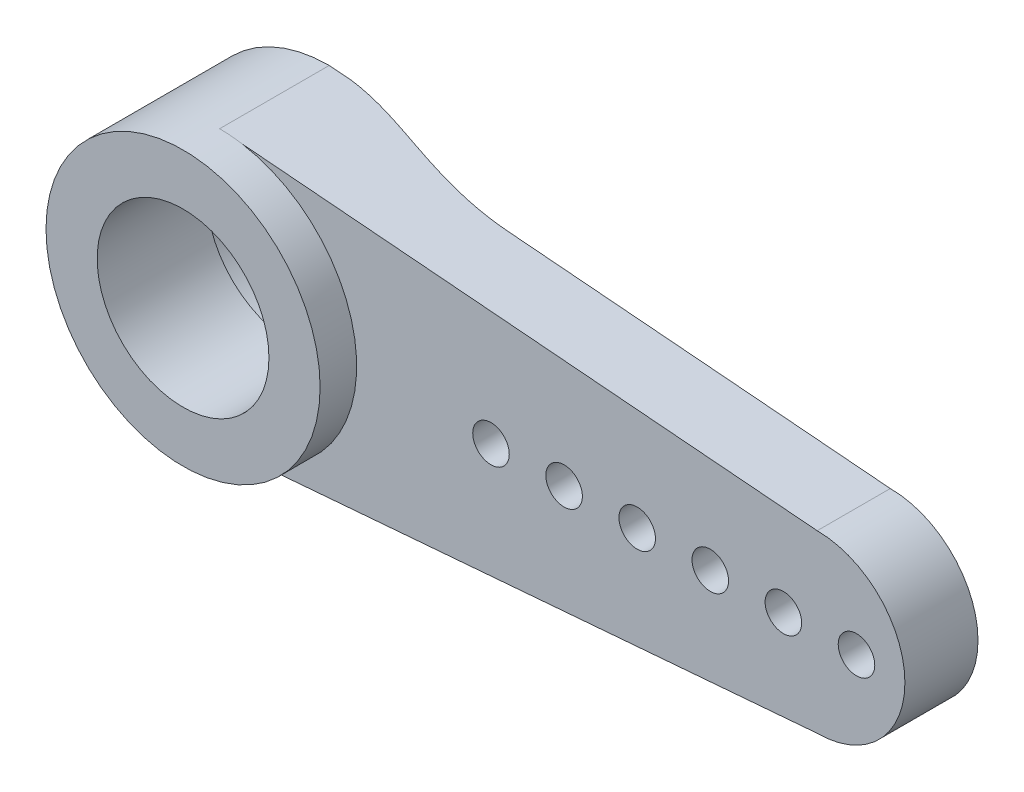
ISO-10303-21;
HEADER;
FILE_DESCRIPTION(('STEP AP214'),'2;1');
FILE_NAME('part.step','',(''),(''),'','','');
FILE_SCHEMA(('AUTOMOTIVE_DESIGN { 1 0 10303 214 1 1 1 1 }'));
ENDSEC;
DATA;
#1=APPLICATION_CONTEXT('core data for automotive mechanical design processes');
#2=APPLICATION_PROTOCOL_DEFINITION('international standard','automotive_design',2000,#1);
#3=PRODUCT_CONTEXT('',#1,'mechanical');
#4=PRODUCT('Part','Part','',(#3));
#5=PRODUCT_RELATED_PRODUCT_CATEGORY('part','',(#4));
#6=PRODUCT_DEFINITION_FORMATION('','',#4);
#7=PRODUCT_DEFINITION_CONTEXT('part definition',#1,'design');
#8=PRODUCT_DEFINITION('design','',#6,#7);
#9=PRODUCT_DEFINITION_SHAPE('','',#8);
#10=(LENGTH_UNIT() NAMED_UNIT(*) SI_UNIT(.MILLI.,.METRE.));
#11=(NAMED_UNIT(*) PLANE_ANGLE_UNIT() SI_UNIT($,.RADIAN.));
#12=(NAMED_UNIT(*) SI_UNIT($,.STERADIAN.) SOLID_ANGLE_UNIT());
#13=UNCERTAINTY_MEASURE_WITH_UNIT(LENGTH_MEASURE(1.E-05),#10,'distance_accuracy_value','');
#14=(GEOMETRIC_REPRESENTATION_CONTEXT(3) GLOBAL_UNCERTAINTY_ASSIGNED_CONTEXT((#13)) GLOBAL_UNIT_ASSIGNED_CONTEXT((#10,
#11,#12)) REPRESENTATION_CONTEXT('',''));
#15=CARTESIAN_POINT('',(0.,0.,0.));
#16=DIRECTION('',(0.,0.,1.));
#17=DIRECTION('',(1.,0.,0.));
#18=AXIS2_PLACEMENT_3D('',#15,#16,#17);
#19=CARTESIAN_POINT('',(0.,0.,0.));
#20=DIRECTION('',(0.,0.,1.));
#21=DIRECTION('',(1.,0.,0.));
#22=AXIS2_PLACEMENT_3D('',#19,#20,#21);
#23=PLANE('',#22);
#24=CARTESIAN_POINT('',(-6.59256176625198,0.,0.));
#25=DIRECTION('',(0.,0.,1.));
#26=DIRECTION('',(1.,0.,0.));
#27=AXIS2_PLACEMENT_3D('',#24,#25,#26);
#28=CIRCLE('',#27,2.35);
#29=CARTESIAN_POINT('',(-4.24256176625198,0.,0.));
#30=VERTEX_POINT('',#29);
#31=EDGE_CURVE('E137',#30,#30,#28,.T.);
#32=ORIENTED_EDGE('',*,*,#31,.T.);
#33=EDGE_LOOP('',(#32));
#34=FACE_BOUND('',#33,.T.);
#35=CARTESIAN_POINT('',(-6.59256176625198,0.,0.));
#36=DIRECTION('',(0.,0.,-1.));
#37=DIRECTION('',(-1.,0.,0.));
#38=AXIS2_PLACEMENT_3D('',#35,#36,#37);
#39=CIRCLE('',#38,2.75);
#40=CARTESIAN_POINT('',(-9.34256176625198,0.,0.));
#41=VERTEX_POINT('',#40);
#42=EDGE_CURVE('E127',#41,#41,#39,.T.);
#43=ORIENTED_EDGE('',*,*,#42,.T.);
#44=EDGE_LOOP('',(#43));
#45=FACE_BOUND('',#44,.T.);
#46=ADVANCED_FACE('F40',(#34,#45),#23,.F.);
#47=CARTESIAN_POINT('',(0.262895209574786,-3.18395309373907,2.));
#48=DIRECTION('',(-0.082288777500487,0.996608527505898,0.));
#49=DIRECTION('',(-0.996608527505899,-0.082288777500487,0.));
#50=AXIS2_PLACEMENT_3D('',#47,#48,#49);
#51=PLANE('',#50);
#52=DIRECTION('',(0.,0.,-1.));
#53=VECTOR('',#52,1.);
#54=CARTESIAN_POINT('',(-6.59256176625198,-3.75,2.));
#55=LINE('',#54,#53);
#56=CARTESIAN_POINT('',(-6.59256176625198,-3.75,2.));
#57=VERTEX_POINT('',#56);
#58=CARTESIAN_POINT('',(-6.59256176625198,-3.75,-1.));
#59=VERTEX_POINT('',#58);
#60=EDGE_CURVE('E152',#57,#59,#55,.T.);
#61=ORIENTED_EDGE('',*,*,#60,.T.);
#62=DIRECTION('',(-0.996608527505899,-0.082288777500487,0.));
#63=VECTOR('',#62,1.);
#64=CARTESIAN_POINT('',(0.262895209574786,-3.18395309373907,-1.));
#65=LINE('',#64,#63);
#66=CARTESIAN_POINT('',(-5.97748903593933,-3.69921417823107,-1.));
#67=VERTEX_POINT('',#66);
#68=EDGE_CURVE('E120',#67,#59,#65,.T.);
#69=ORIENTED_EDGE('',*,*,#68,.F.);
#70=CARTESIAN_POINT('',(-5.97748903593933,-3.69921417823107,-1.));
#71=CARTESIAN_POINT('',(-5.90889890667234,-3.69355077306223,-0.995763036319074));
#72=CARTESIAN_POINT('',(-5.84040693931134,-3.6878954730049,-0.990117624215157));
#73=CARTESIAN_POINT('',(-5.70370841124851,-3.67660843857769,-0.976240847471814));
#74=CARTESIAN_POINT('',(-5.63550175259074,-3.67097669611971,-0.968010459561936));
#75=CARTESIAN_POINT('',(-5.43181465119597,-3.65415849508712,-0.939843550831977));
#76=CARTESIAN_POINT('',(-5.29681389271552,-3.64301164346947,-0.916400273744535));
#77=CARTESIAN_POINT('',(-5.02830009939376,-3.6208407798007,-0.862569100873914));
#78=CARTESIAN_POINT('',(-4.8947865880605,-3.60981672840621,-0.832183500585761));
#79=CARTESIAN_POINT('',(-4.62868968445085,-3.58784542443844,-0.766923580565429));
#80=CARTESIAN_POINT('',(-4.49610776320966,-3.57689829332678,-0.732043352115459));
#81=CARTESIAN_POINT('',(-4.21297015312032,-3.55351995854876,-0.655039928293991));
#82=CARTESIAN_POINT('',(-4.06250543854113,-3.54109626651929,-0.612587519576705));
#83=CARTESIAN_POINT('',(-3.76157540548402,-3.51624883259714,-0.527663076461232));
#84=CARTESIAN_POINT('',(-3.61111008724035,-3.50382509072381,-0.485191041321472));
#85=CARTESIAN_POINT('',(-3.30983970544998,-3.47894955461268,-0.402618319882844));
#86=CARTESIAN_POINT('',(-3.15903588515265,-3.4664978630285,-0.36251315051154));
#87=CARTESIAN_POINT('',(-2.85638854942886,-3.44150863347332,-0.286486684142656));
#88=CARTESIAN_POINT('',(-2.70454517002457,-3.42897110673352,-0.250564850445772));
#89=CARTESIAN_POINT('',(-2.3992254150713,-3.40376121870985,-0.184414258906656));
#90=CARTESIAN_POINT('',(-2.24574596402805,-3.3910886034861,-0.154199573161321));
#91=CARTESIAN_POINT('',(-1.93757639807946,-3.36564340996741,-0.100948744526236));
#92=CARTESIAN_POINT('',(-1.7828865871657,-3.35287085677269,-0.0779108549246106));
#93=CARTESIAN_POINT('',(-1.47108304845633,-3.32712561045724,-0.0400260488982376));
#94=CARTESIAN_POINT('',(-1.31396001596624,-3.31415214905898,-0.0252542451194786));
#95=CARTESIAN_POINT('',(-0.998955176093607,-3.28814257512454,-0.00522196731998075));
#96=CARTESIAN_POINT('',(-0.841072740149921,-3.27510641068882,2.83900751429704E-05));
#97=CARTESIAN_POINT('',(-0.683125887139329,-3.26206492741272,0.));
#98=B_SPLINE_CURVE_WITH_KNOTS('',3,(#70,#71,#72,#73,#74,#75,#76,#77,#78,#79,#80,#81,#82,#83,#84,
#85,#86,#87,#88,#89,#90,#91,#92,#93,#94,#95,#96,#97),.UNSPECIFIED.,.F.,.F.,(4,2,2,2,2,2,2,2,2,2,
2,2,2,4),(0.,0.206828623332872,0.413579190582996,0.825716254636397,1.23771724134261,
1.65026548555027,2.12075724618994,2.59126853869818,3.06085797279234,3.53038709458113,
4.00105923721196,4.47161673647357,4.94638343052673,5.42165427372986),.UNSPECIFIED.);
#99=CARTESIAN_POINT('',(-0.683125887139329,-3.26206492741272,0.));
#100=VERTEX_POINT('',#99);
#101=EDGE_CURVE('E54',#67,#100,#98,.T.);
#102=ORIENTED_EDGE('',*,*,#101,.T.);
#103=DIRECTION('',(0.996608527505899,0.082288777500487,0.));
#104=VECTOR('',#103,1.);
#105=CARTESIAN_POINT('',(0.262895209574786,-3.18395309373907,0.));
#106=LINE('',#105,#104);
#107=CARTESIAN_POINT('',(9.75743823374803,-2.4,0.));
#108=VERTEX_POINT('',#107);
#109=EDGE_CURVE('E155',#100,#108,#106,.T.);
#110=ORIENTED_EDGE('',*,*,#109,.T.);
#111=DIRECTION('',(0.,0.,-1.));
#112=VECTOR('',#111,1.);
#113=CARTESIAN_POINT('',(9.75743823374803,-2.4,2.));
#114=LINE('',#113,#112);
#115=CARTESIAN_POINT('',(9.75743823374803,-2.4,2.));
#116=VERTEX_POINT('',#115);
#117=EDGE_CURVE('E166',#116,#108,#114,.T.);
#118=ORIENTED_EDGE('',*,*,#117,.F.);
#119=DIRECTION('',(0.996608527505899,0.082288777500487,0.));
#120=VECTOR('',#119,1.);
#121=CARTESIAN_POINT('',(0.262895209574786,-3.18395309373907,2.));
#122=LINE('',#121,#120);
#123=CARTESIAN_POINT('',(-5.97748903593933,-3.69921417823107,2.));
#124=VERTEX_POINT('',#123);
#125=EDGE_CURVE('E146',#124,#116,#122,.T.);
#126=ORIENTED_EDGE('',*,*,#125,.F.);
#127=EDGE_CURVE('E142',#57,#124,#122,.T.);
#128=ORIENTED_EDGE('',*,*,#127,.F.);
#129=EDGE_LOOP('',(#61,#69,#102,#110,#118,#126,#128));
#130=FACE_BOUND('',#129,.T.);
#131=ADVANCED_FACE('F174',(#130),#51,.F.);
#132=CARTESIAN_POINT('',(9.75743823374803,0.,2.));
#133=DIRECTION('',(0.,0.,-1.));
#134=DIRECTION('',(-1.,0.,0.));
#135=AXIS2_PLACEMENT_3D('',#132,#133,#134);
#136=CYLINDRICAL_SURFACE('',#135,2.4);
#137=CARTESIAN_POINT('',(9.75743823374803,0.,0.));
#138=DIRECTION('',(0.,0.,1.));
#139=DIRECTION('',(1.,0.,0.));
#140=AXIS2_PLACEMENT_3D('',#137,#138,#139);
#141=CIRCLE('',#140,2.4);
#142=CARTESIAN_POINT('',(9.75743823374803,2.4,0.));
#143=VERTEX_POINT('',#142);
#144=EDGE_CURVE('E157',#108,#143,#141,.T.);
#145=ORIENTED_EDGE('',*,*,#144,.T.);
#146=DIRECTION('',(0.,0.,-1.));
#147=VECTOR('',#146,1.);
#148=CARTESIAN_POINT('',(9.75743823374803,2.4,2.));
#149=LINE('',#148,#147);
#150=CARTESIAN_POINT('',(9.75743823374803,2.4,2.));
#151=VERTEX_POINT('',#150);
#152=EDGE_CURVE('E164',#151,#143,#149,.T.);
#153=ORIENTED_EDGE('',*,*,#152,.F.);
#154=CARTESIAN_POINT('',(9.75743823374803,0.,2.));
#155=DIRECTION('',(0.,0.,1.));
#156=DIRECTION('',(1.,0.,0.));
#157=AXIS2_PLACEMENT_3D('',#154,#155,#156);
#158=CIRCLE('',#157,2.4);
#159=EDGE_CURVE('E145',#116,#151,#158,.T.);
#160=ORIENTED_EDGE('',*,*,#159,.F.);
#161=ORIENTED_EDGE('',*,*,#117,.T.);
#162=EDGE_LOOP('',(#145,#153,#160,#161));
#163=FACE_BOUND('',#162,.T.);
#164=ADVANCED_FACE('F178',(#163),#136,.T.);
#165=CARTESIAN_POINT('',(0.262895209574786,3.18395309373907,2.));
#166=DIRECTION('',(0.082288777500487,0.996608527505898,0.));
#167=DIRECTION('',(-0.996608527505899,0.082288777500487,0.));
#168=AXIS2_PLACEMENT_3D('',#165,#166,#167);
#169=PLANE('',#168);
#170=DIRECTION('',(0.996608527505899,-0.082288777500487,0.));
#171=VECTOR('',#170,1.);
#172=CARTESIAN_POINT('',(0.262895209574786,3.18395309373907,0.));
#173=LINE('',#172,#171);
#174=CARTESIAN_POINT('',(-0.683125887139329,3.26206492741272,0.));
#175=VERTEX_POINT('',#174);
#176=EDGE_CURVE('E107',#175,#143,#173,.T.);
#177=ORIENTED_EDGE('',*,*,#176,.F.);
#178=CARTESIAN_POINT('',(-0.683125887139329,3.26206492741272,0.));
#179=CARTESIAN_POINT('',(-0.776453659199816,3.2697708902434,1.86031690557863E-06));
#180=CARTESIAN_POINT('',(-0.869768246239271,3.27747576440262,-0.00182470285755424));
#181=CARTESIAN_POINT('',(-1.05624741305678,3.2928731268004,-0.0089464342579777));
#182=CARTESIAN_POINT('',(-1.14941202016776,3.3005656172958,-0.014240875668113));
#183=CARTESIAN_POINT('',(-1.42822561016541,3.32358692289194,-0.0350204923725436));
#184=CARTESIAN_POINT('',(-1.61352457300247,3.33888683725463,-0.0554033000199369));
#185=CARTESIAN_POINT('',(-1.9821099087611,3.36932048883103,-0.10739664407118));
#186=CARTESIAN_POINT('',(-2.16539960376573,3.38445450034517,-0.138984303077121));
#187=CARTESIAN_POINT('',(-2.53024499453694,3.41457934912445,-0.211289568381177));
#188=CARTESIAN_POINT('',(-2.71179976780432,3.42957011021992,-0.252011777655355));
#189=CARTESIAN_POINT('',(-3.02038647428273,3.45504974653465,-0.327129607218174));
#190=CARTESIAN_POINT('',(-3.14782415889436,3.46557212416313,-0.359888657985523));
#191=CARTESIAN_POINT('',(-3.40211444318964,3.4865685696554,-0.427605519157071));
#192=CARTESIAN_POINT('',(-3.52896704069653,3.49704263733946,-0.462563337734489));
#193=CARTESIAN_POINT('',(-3.78230603425314,3.51796053589,-0.533399092998494));
#194=CARTESIAN_POINT('',(-3.90879263812572,3.52840438391618,-0.569276294403225));
#195=CARTESIAN_POINT('',(-4.16194032242292,3.54930648628934,-0.640507531752915));
#196=CARTESIAN_POINT('',(-4.28860143065139,3.55976474293206,-0.675861470294165));
#197=CARTESIAN_POINT('',(-4.54330326950771,3.58079516999359,-0.744499151111776));
#198=CARTESIAN_POINT('',(-4.67134771874857,3.59136764745385,-0.777769211583597));
#199=CARTESIAN_POINT('',(-4.92849336098913,3.61259985644619,-0.839934794532199));
#200=CARTESIAN_POINT('',(-5.05759432325193,3.6232595689266,-0.86883124665313));
#201=CARTESIAN_POINT('',(-5.2524992938025,3.63935263988949,-0.907259821265145));
#202=CARTESIAN_POINT('',(-5.31781678433789,3.64474582718141,-0.9192702643249));
#203=CARTESIAN_POINT('',(-5.44877614146758,3.65555898510954,-0.94133956928348));
#204=CARTESIAN_POINT('',(-5.51441798265249,3.66097895364775,-0.951398581646118));
#205=CARTESIAN_POINT('',(-5.64615074999323,3.6718559711346,-0.96932224392189));
#206=CARTESIAN_POINT('',(-5.71224235047345,3.67731307576141,-0.977181960460564));
#207=CARTESIAN_POINT('',(-5.84468913765656,3.68824904901506,-0.990469367033643));
#208=CARTESIAN_POINT('',(-5.91104440553063,3.69372792434411,-0.995896238267159));
#209=CARTESIAN_POINT('',(-5.97748903593933,3.69921417823107,-1.));
#210=B_SPLINE_CURVE_WITH_KNOTS('',3,(#178,#179,#180,#181,#182,#183,#184,#185,#186,#187,#188,
#189,#190,#191,#192,#193,#194,#195,#196,#197,#198,#199,#200,#201,#202,#203,#204,#205,#206,#207,
#208,#209),.UNSPECIFIED.,.F.,.F.,(4,2,2,2,2,2,2,2,2,2,2,2,2,2,2,4),(0.,0.280895826758577,
0.561732800748642,1.12241509307989,1.68195914518313,2.24178579214522,2.63776535897615,
3.03374639782173,3.42942006620094,3.82516648439255,4.22328545892771,4.62131969100484,
4.82118870082108,5.02104229373506,5.22134066082432,5.42170639001788),.UNSPECIFIED.);
#211=CARTESIAN_POINT('',(-5.97748903593933,3.69921417823107,-1.));
#212=VERTEX_POINT('',#211);
#213=EDGE_CURVE('E11',#175,#212,#210,.T.);
#214=ORIENTED_EDGE('',*,*,#213,.T.);
#215=DIRECTION('',(0.996608527505899,-0.082288777500487,0.));
#216=VECTOR('',#215,1.);
#217=CARTESIAN_POINT('',(0.262895209574786,3.18395309373907,-1.));
#218=LINE('',#217,#216);
#219=CARTESIAN_POINT('',(-6.59256176625198,3.75,-1.));
#220=VERTEX_POINT('',#219);
#221=EDGE_CURVE('E105',#220,#212,#218,.T.);
#222=ORIENTED_EDGE('',*,*,#221,.F.);
#223=DIRECTION('',(0.,0.,-1.));
#224=VECTOR('',#223,1.);
#225=CARTESIAN_POINT('',(-6.59256176625198,3.75,2.));
#226=LINE('',#225,#224);
#227=CARTESIAN_POINT('',(-6.59256176625198,3.75,2.));
#228=VERTEX_POINT('',#227);
#229=EDGE_CURVE('E162',#228,#220,#226,.T.);
#230=ORIENTED_EDGE('',*,*,#229,.F.);
#231=DIRECTION('',(0.996608527505899,-0.082288777500487,0.));
#232=VECTOR('',#231,1.);
#233=CARTESIAN_POINT('',(0.262895209574786,3.18395309373907,2.));
#234=LINE('',#233,#232);
#235=CARTESIAN_POINT('',(-5.97748903593933,3.69921417823107,2.));
#236=VERTEX_POINT('',#235);
#237=EDGE_CURVE('E150',#228,#236,#234,.T.);
#238=ORIENTED_EDGE('',*,*,#237,.T.);
#239=EDGE_CURVE('E149',#236,#151,#234,.T.);
#240=ORIENTED_EDGE('',*,*,#239,.T.);
#241=ORIENTED_EDGE('',*,*,#152,.T.);
#242=EDGE_LOOP('',(#177,#214,#222,#230,#238,#240,#241));
#243=FACE_BOUND('',#242,.T.);
#244=ADVANCED_FACE('F104',(#243),#169,.T.);
#245=CARTESIAN_POINT('',(-6.59256176625198,0.,2.));
#246=DIRECTION('',(0.,0.,-1.));
#247=DIRECTION('',(-1.,0.,0.));
#248=AXIS2_PLACEMENT_3D('',#245,#246,#247);
#249=CYLINDRICAL_SURFACE('',#248,2.35);
#250=ORIENTED_EDGE('',*,*,#31,.F.);
#251=EDGE_LOOP('',(#250));
#252=FACE_BOUND('',#251,.T.);
#253=CARTESIAN_POINT('',(-6.59256176625198,0.,3.));
#254=DIRECTION('',(0.,0.,1.));
#255=DIRECTION('',(1.,0.,0.));
#256=AXIS2_PLACEMENT_3D('',#253,#254,#255);
#257=CIRCLE('',#256,2.35);
#258=CARTESIAN_POINT('',(-4.24256176625198,0.,3.));
#259=VERTEX_POINT('',#258);
#260=EDGE_CURVE('E126',#259,#259,#257,.T.);
#261=ORIENTED_EDGE('',*,*,#260,.T.);
#262=EDGE_LOOP('',(#261));
#263=FACE_BOUND('',#262,.T.);
#264=ADVANCED_FACE('F179',(#252,#263),#249,.F.);
#265=CARTESIAN_POINT('',(-6.59256176625198,0.,2.));
#266=DIRECTION('',(0.,0.,-1.));
#267=DIRECTION('',(-1.,0.,0.));
#268=AXIS2_PLACEMENT_3D('',#265,#266,#267);
#269=CYLINDRICAL_SURFACE('',#268,3.75);
#270=ORIENTED_EDGE('',*,*,#229,.T.);
#271=CARTESIAN_POINT('',(-6.59256176625198,0.,-1.));
#272=DIRECTION('',(0.,0.,-1.));
#273=DIRECTION('',(-1.,0.,0.));
#274=AXIS2_PLACEMENT_3D('',#271,#272,#273);
#275=CIRCLE('',#274,3.75);
#276=EDGE_CURVE('E117',#59,#220,#275,.T.);
#277=ORIENTED_EDGE('',*,*,#276,.F.);
#278=ORIENTED_EDGE('',*,*,#60,.F.);
#279=CARTESIAN_POINT('',(-6.59256176625198,0.,2.));
#280=DIRECTION('',(0.,0.,1.));
#281=DIRECTION('',(1.,0.,0.));
#282=AXIS2_PLACEMENT_3D('',#279,#280,#281);
#283=CIRCLE('',#282,3.75);
#284=EDGE_CURVE('E133',#57,#124,#283,.T.);
#285=ORIENTED_EDGE('',*,*,#284,.T.);
#286=EDGE_CURVE('E141',#124,#236,#283,.T.);
#287=ORIENTED_EDGE('',*,*,#286,.T.);
#288=EDGE_CURVE('E138',#236,#228,#283,.T.);
#289=ORIENTED_EDGE('',*,*,#288,.T.);
#290=EDGE_LOOP('',(#270,#277,#278,#285,#287,#289));
#291=FACE_BOUND('',#290,.T.);
#292=CARTESIAN_POINT('',(-6.59256176625198,0.,3.));
#293=DIRECTION('',(0.,0.,1.));
#294=DIRECTION('',(-1.,0.,0.));
#295=AXIS2_PLACEMENT_3D('',#292,#293,#294);
#296=CIRCLE('',#295,3.75);
#297=CARTESIAN_POINT('',(-10.342561766252,0.,3.));
#298=VERTEX_POINT('',#297);
#299=EDGE_CURVE('E134',#298,#298,#296,.T.);
#300=ORIENTED_EDGE('',*,*,#299,.F.);
#301=EDGE_LOOP('',(#300));
#302=FACE_BOUND('',#301,.T.);
#303=ADVANCED_FACE('F181',(#291,#302),#269,.T.);
#304=CARTESIAN_POINT('',(0.,0.,2.));
#305=DIRECTION('',(0.,0.,1.));
#306=DIRECTION('',(1.,0.,0.));
#307=AXIS2_PLACEMENT_3D('',#304,#305,#306);
#308=PLANE('',#307);
#309=CARTESIAN_POINT('',(10.8327538166482,0.,2.));
#310=DIRECTION('',(0.,0.,1.));
#311=DIRECTION('',(1.,0.,0.));
#312=AXIS2_PLACEMENT_3D('',#309,#310,#311);
#313=CIRCLE('',#312,0.500000000000001);
#314=CARTESIAN_POINT('',(11.3327538166482,0.,2.));
#315=VERTEX_POINT('',#314);
#316=EDGE_CURVE('E292',#315,#315,#313,.F.);
#317=ORIENTED_EDGE('',*,*,#316,.T.);
#318=EDGE_LOOP('',(#317));
#319=FACE_BOUND('',#318,.T.);
#320=CARTESIAN_POINT('',(8.83275381664821,0.,2.));
#321=DIRECTION('',(0.,0.,1.));
#322=DIRECTION('',(1.,0.,0.));
#323=AXIS2_PLACEMENT_3D('',#320,#321,#322);
#324=CIRCLE('',#323,0.500000000000001);
#325=CARTESIAN_POINT('',(9.33275381664821,0.,2.));
#326=VERTEX_POINT('',#325);
#327=EDGE_CURVE('E297',#326,#326,#324,.F.);
#328=ORIENTED_EDGE('',*,*,#327,.T.);
#329=EDGE_LOOP('',(#328));
#330=FACE_BOUND('',#329,.T.);
#331=CARTESIAN_POINT('',(6.83275381664821,0.,2.));
#332=DIRECTION('',(0.,0.,1.));
#333=DIRECTION('',(1.,0.,0.));
#334=AXIS2_PLACEMENT_3D('',#331,#332,#333);
#335=CIRCLE('',#334,0.500000000000001);
#336=CARTESIAN_POINT('',(7.33275381664821,0.,2.));
#337=VERTEX_POINT('',#336);
#338=EDGE_CURVE('E301',#337,#337,#335,.F.);
#339=ORIENTED_EDGE('',*,*,#338,.T.);
#340=EDGE_LOOP('',(#339));
#341=FACE_BOUND('',#340,.T.);
#342=CARTESIAN_POINT('',(4.83275381664821,0.,2.));
#343=DIRECTION('',(0.,0.,1.));
#344=DIRECTION('',(1.,0.,0.));
#345=AXIS2_PLACEMENT_3D('',#342,#343,#344);
#346=CIRCLE('',#345,0.500000000000001);
#347=CARTESIAN_POINT('',(5.33275381664821,0.,2.));
#348=VERTEX_POINT('',#347);
#349=EDGE_CURVE('E305',#348,#348,#346,.F.);
#350=ORIENTED_EDGE('',*,*,#349,.T.);
#351=EDGE_LOOP('',(#350));
#352=FACE_BOUND('',#351,.T.);
#353=CARTESIAN_POINT('',(2.83275381664821,0.,2.));
#354=DIRECTION('',(0.,0.,1.));
#355=DIRECTION('',(1.,0.,0.));
#356=AXIS2_PLACEMENT_3D('',#353,#354,#355);
#357=CIRCLE('',#356,0.500000000000001);
#358=CARTESIAN_POINT('',(3.33275381664821,0.,2.));
#359=VERTEX_POINT('',#358);
#360=EDGE_CURVE('E309',#359,#359,#357,.F.);
#361=ORIENTED_EDGE('',*,*,#360,.T.);
#362=EDGE_LOOP('',(#361));
#363=FACE_BOUND('',#362,.T.);
#364=CARTESIAN_POINT('',(0.832753816648208,0.,2.));
#365=DIRECTION('',(0.,0.,1.));
#366=DIRECTION('',(1.,0.,0.));
#367=AXIS2_PLACEMENT_3D('',#364,#365,#366);
#368=CIRCLE('',#367,0.500000000000001);
#369=CARTESIAN_POINT('',(1.33275381664821,0.,2.));
#370=VERTEX_POINT('',#369);
#371=EDGE_CURVE('E313',#370,#370,#368,.F.);
#372=ORIENTED_EDGE('',*,*,#371,.T.);
#373=EDGE_LOOP('',(#372));
#374=FACE_BOUND('',#373,.T.);
#375=ORIENTED_EDGE('',*,*,#286,.F.);
#376=ORIENTED_EDGE('',*,*,#125,.T.);
#377=ORIENTED_EDGE('',*,*,#159,.T.);
#378=ORIENTED_EDGE('',*,*,#239,.F.);
#379=EDGE_LOOP('',(#375,#376,#377,#378));
#380=FACE_BOUND('',#379,.T.);
#381=ADVANCED_FACE('F187',(#319,#330,#341,#352,#363,#374,#380),#308,.T.);
#382=CARTESIAN_POINT('',(10.8327538166482,0.,0.));
#383=DIRECTION('',(0.,0.,-1.));
#384=DIRECTION('',(-1.,0.,0.));
#385=AXIS2_PLACEMENT_3D('',#382,#383,#384);
#386=CIRCLE('',#385,0.500000000000001);
#387=CARTESIAN_POINT('',(10.3327538166482,0.,0.));
#388=VERTEX_POINT('',#387);
#389=EDGE_CURVE('E130',#388,#388,#386,.T.);
#390=ORIENTED_EDGE('',*,*,#389,.F.);
#391=EDGE_LOOP('',(#390));
#392=FACE_BOUND('',#391,.T.);
#393=CARTESIAN_POINT('',(8.83275381664821,0.,0.));
#394=DIRECTION('',(0.,0.,-1.));
#395=DIRECTION('',(-1.,0.,0.));
#396=AXIS2_PLACEMENT_3D('',#393,#394,#395);
#397=CIRCLE('',#396,0.500000000000001);
#398=CARTESIAN_POINT('',(8.33275381664821,0.,0.));
#399=VERTEX_POINT('',#398);
#400=EDGE_CURVE('E218',#399,#399,#397,.T.);
#401=ORIENTED_EDGE('',*,*,#400,.F.);
#402=EDGE_LOOP('',(#401));
#403=FACE_BOUND('',#402,.T.);
#404=CARTESIAN_POINT('',(6.83275381664821,0.,0.));
#405=DIRECTION('',(0.,0.,-1.));
#406=DIRECTION('',(-1.,0.,0.));
#407=AXIS2_PLACEMENT_3D('',#404,#405,#406);
#408=CIRCLE('',#407,0.500000000000001);
#409=CARTESIAN_POINT('',(6.33275381664821,0.,0.));
#410=VERTEX_POINT('',#409);
#411=EDGE_CURVE('E222',#410,#410,#408,.T.);
#412=ORIENTED_EDGE('',*,*,#411,.F.);
#413=EDGE_LOOP('',(#412));
#414=FACE_BOUND('',#413,.T.);
#415=CARTESIAN_POINT('',(4.83275381664821,0.,0.));
#416=DIRECTION('',(0.,0.,-1.));
#417=DIRECTION('',(-1.,0.,0.));
#418=AXIS2_PLACEMENT_3D('',#415,#416,#417);
#419=CIRCLE('',#418,0.500000000000001);
#420=CARTESIAN_POINT('',(4.33275381664821,0.,0.));
#421=VERTEX_POINT('',#420);
#422=EDGE_CURVE('E226',#421,#421,#419,.T.);
#423=ORIENTED_EDGE('',*,*,#422,.F.);
#424=EDGE_LOOP('',(#423));
#425=FACE_BOUND('',#424,.T.);
#426=CARTESIAN_POINT('',(2.83275381664821,0.,0.));
#427=DIRECTION('',(0.,0.,-1.));
#428=DIRECTION('',(-1.,0.,0.));
#429=AXIS2_PLACEMENT_3D('',#426,#427,#428);
#430=CIRCLE('',#429,0.500000000000001);
#431=CARTESIAN_POINT('',(2.33275381664821,0.,0.));
#432=VERTEX_POINT('',#431);
#433=EDGE_CURVE('E230',#432,#432,#430,.T.);
#434=ORIENTED_EDGE('',*,*,#433,.F.);
#435=EDGE_LOOP('',(#434));
#436=FACE_BOUND('',#435,.T.);
#437=CARTESIAN_POINT('',(0.832753816648208,0.,0.));
#438=DIRECTION('',(0.,0.,-1.));
#439=DIRECTION('',(-1.,0.,0.));
#440=AXIS2_PLACEMENT_3D('',#437,#438,#439);
#441=CIRCLE('',#440,0.500000000000001);
#442=CARTESIAN_POINT('',(0.332753816648207,0.,0.));
#443=VERTEX_POINT('',#442);
#444=EDGE_CURVE('E233',#443,#443,#441,.T.);
#445=ORIENTED_EDGE('',*,*,#444,.F.);
#446=EDGE_LOOP('',(#445));
#447=FACE_BOUND('',#446,.T.);
#448=ORIENTED_EDGE('',*,*,#109,.F.);
#449=CARTESIAN_POINT('',(-6.59256176625198,0.,0.));
#450=DIRECTION('',(0.,0.,1.));
#451=DIRECTION('',(1.,0.,0.));
#452=AXIS2_PLACEMENT_3D('',#449,#450,#451);
#453=CIRCLE('',#452,6.75);
#454=EDGE_CURVE('E67',#100,#175,#453,.T.);
#455=ORIENTED_EDGE('',*,*,#454,.T.);
#456=ORIENTED_EDGE('',*,*,#176,.T.);
#457=ORIENTED_EDGE('',*,*,#144,.F.);
#458=EDGE_LOOP('',(#448,#455,#456,#457));
#459=FACE_BOUND('',#458,.T.);
#460=ADVANCED_FACE('F195',(#392,#403,#414,#425,#436,#447,#459),#23,.F.);
#461=CARTESIAN_POINT('',(-6.59256176625198,0.,2.));
#462=DIRECTION('',(0.,0.,-1.));
#463=DIRECTION('',(-1.,0.,0.));
#464=AXIS2_PLACEMENT_3D('',#461,#462,#463);
#465=PLANE('',#464);
#466=ORIENTED_EDGE('',*,*,#237,.F.);
#467=ORIENTED_EDGE('',*,*,#288,.F.);
#468=EDGE_LOOP('',(#466,#467));
#469=FACE_BOUND('',#468,.T.);
#470=ADVANCED_FACE('F201',(#469),#465,.T.);
#471=CARTESIAN_POINT('',(-6.59256176625198,0.,3.));
#472=DIRECTION('',(0.,0.,-1.));
#473=DIRECTION('',(-1.,0.,0.));
#474=AXIS2_PLACEMENT_3D('',#471,#472,#473);
#475=PLANE('',#474);
#476=ORIENTED_EDGE('',*,*,#299,.T.);
#477=EDGE_LOOP('',(#476));
#478=FACE_BOUND('',#477,.T.);
#479=ORIENTED_EDGE('',*,*,#260,.F.);
#480=EDGE_LOOP('',(#479));
#481=FACE_BOUND('',#480,.T.);
#482=ADVANCED_FACE('F207',(#478,#481),#475,.F.);
#483=ORIENTED_EDGE('',*,*,#284,.F.);
#484=ORIENTED_EDGE('',*,*,#127,.T.);
#485=EDGE_LOOP('',(#483,#484));
#486=FACE_BOUND('',#485,.T.);
#487=ADVANCED_FACE('F210',(#486),#465,.T.);
#488=CARTESIAN_POINT('',(-6.59256176625198,0.,-1.));
#489=DIRECTION('',(0.,0.,1.));
#490=DIRECTION('',(1.,0.,0.));
#491=AXIS2_PLACEMENT_3D('',#488,#489,#490);
#492=CYLINDRICAL_SURFACE('',#491,2.75);
#493=CARTESIAN_POINT('',(-6.59256176625198,0.,-1.));
#494=DIRECTION('',(0.,0.,-1.));
#495=DIRECTION('',(-1.,0.,0.));
#496=AXIS2_PLACEMENT_3D('',#493,#494,#495);
#497=CIRCLE('',#496,2.75);
#498=CARTESIAN_POINT('',(-9.34256176625198,0.,-1.));
#499=VERTEX_POINT('',#498);
#500=EDGE_CURVE('E118',#499,#499,#497,.T.);
#501=ORIENTED_EDGE('',*,*,#500,.T.);
#502=EDGE_LOOP('',(#501));
#503=FACE_BOUND('',#502,.T.);
#504=ORIENTED_EDGE('',*,*,#42,.F.);
#505=EDGE_LOOP('',(#504));
#506=FACE_BOUND('',#505,.T.);
#507=ADVANCED_FACE('F251',(#503,#506),#492,.F.);
#508=CARTESIAN_POINT('',(0.,0.,-1.));
#509=DIRECTION('',(0.,0.,-1.));
#510=DIRECTION('',(-1.,0.,0.));
#511=AXIS2_PLACEMENT_3D('',#508,#509,#510);
#512=PLANE('',#511);
#513=ORIENTED_EDGE('',*,*,#500,.F.);
#514=EDGE_LOOP('',(#513));
#515=FACE_BOUND('',#514,.T.);
#516=ORIENTED_EDGE('',*,*,#221,.T.);
#517=CARTESIAN_POINT('',(-6.59256176625198,0.,-1.));
#518=DIRECTION('',(0.,0.,-1.));
#519=DIRECTION('',(-1.,0.,0.));
#520=AXIS2_PLACEMENT_3D('',#517,#518,#519);
#521=CIRCLE('',#520,3.75);
#522=EDGE_CURVE('E115',#212,#67,#521,.T.);
#523=ORIENTED_EDGE('',*,*,#522,.T.);
#524=ORIENTED_EDGE('',*,*,#68,.T.);
#525=ORIENTED_EDGE('',*,*,#276,.T.);
#526=EDGE_LOOP('',(#516,#523,#524,#525));
#527=FACE_BOUND('',#526,.T.);
#528=ADVANCED_FACE('F113',(#515,#527),#512,.T.);
#529=CARTESIAN_POINT('',(-6.59256176625198,0.,-5.));
#530=DIRECTION('',(0.,0.,1.));
#531=DIRECTION('',(1.,0.,0.));
#532=AXIS2_PLACEMENT_3D('',#529,#530,#531);
#533=TOROIDAL_SURFACE('',#532,6.75,5.);
#534=ORIENTED_EDGE('',*,*,#213,.F.);
#535=ORIENTED_EDGE('',*,*,#454,.F.);
#536=ORIENTED_EDGE('',*,*,#101,.F.);
#537=ORIENTED_EDGE('',*,*,#522,.F.);
#538=EDGE_LOOP('',(#534,#535,#536,#537));
#539=FACE_BOUND('',#538,.T.);
#540=ADVANCED_FACE('F42',(#539),#533,.F.);
#541=CARTESIAN_POINT('',(0.832753816648208,0.,3.001));
#542=DIRECTION('',(0.,0.,-1.));
#543=DIRECTION('',(-1.,0.,0.));
#544=AXIS2_PLACEMENT_3D('',#541,#542,#543);
#545=CYLINDRICAL_SURFACE('',#544,0.500000000000001);
#546=ORIENTED_EDGE('',*,*,#371,.F.);
#547=EDGE_LOOP('',(#546));
#548=FACE_BOUND('',#547,.T.);
#549=ORIENTED_EDGE('',*,*,#444,.T.);
#550=EDGE_LOOP('',(#549));
#551=FACE_BOUND('',#550,.T.);
#552=ADVANCED_FACE('F264',(#548,#551),#545,.F.);
#553=CARTESIAN_POINT('',(2.83275381664821,0.,3.001));
#554=DIRECTION('',(0.,0.,-1.));
#555=DIRECTION('',(-1.,0.,0.));
#556=AXIS2_PLACEMENT_3D('',#553,#554,#555);
#557=CYLINDRICAL_SURFACE('',#556,0.500000000000001);
#558=ORIENTED_EDGE('',*,*,#360,.F.);
#559=EDGE_LOOP('',(#558));
#560=FACE_BOUND('',#559,.T.);
#561=ORIENTED_EDGE('',*,*,#433,.T.);
#562=EDGE_LOOP('',(#561));
#563=FACE_BOUND('',#562,.T.);
#564=ADVANCED_FACE('F267',(#560,#563),#557,.F.);
#565=CARTESIAN_POINT('',(4.83275381664821,0.,3.001));
#566=DIRECTION('',(0.,0.,-1.));
#567=DIRECTION('',(-1.,0.,0.));
#568=AXIS2_PLACEMENT_3D('',#565,#566,#567);
#569=CYLINDRICAL_SURFACE('',#568,0.500000000000001);
#570=ORIENTED_EDGE('',*,*,#349,.F.);
#571=EDGE_LOOP('',(#570));
#572=FACE_BOUND('',#571,.T.);
#573=ORIENTED_EDGE('',*,*,#422,.T.);
#574=EDGE_LOOP('',(#573));
#575=FACE_BOUND('',#574,.T.);
#576=ADVANCED_FACE('F271',(#572,#575),#569,.F.);
#577=CARTESIAN_POINT('',(6.83275381664821,0.,3.001));
#578=DIRECTION('',(0.,0.,-1.));
#579=DIRECTION('',(-1.,0.,0.));
#580=AXIS2_PLACEMENT_3D('',#577,#578,#579);
#581=CYLINDRICAL_SURFACE('',#580,0.500000000000001);
#582=ORIENTED_EDGE('',*,*,#338,.F.);
#583=EDGE_LOOP('',(#582));
#584=FACE_BOUND('',#583,.T.);
#585=ORIENTED_EDGE('',*,*,#411,.T.);
#586=EDGE_LOOP('',(#585));
#587=FACE_BOUND('',#586,.T.);
#588=ADVANCED_FACE('F275',(#584,#587),#581,.F.);
#589=CARTESIAN_POINT('',(8.83275381664821,0.,3.001));
#590=DIRECTION('',(0.,0.,-1.));
#591=DIRECTION('',(-1.,0.,0.));
#592=AXIS2_PLACEMENT_3D('',#589,#590,#591);
#593=CYLINDRICAL_SURFACE('',#592,0.500000000000001);
#594=ORIENTED_EDGE('',*,*,#327,.F.);
#595=EDGE_LOOP('',(#594));
#596=FACE_BOUND('',#595,.T.);
#597=ORIENTED_EDGE('',*,*,#400,.T.);
#598=EDGE_LOOP('',(#597));
#599=FACE_BOUND('',#598,.T.);
#600=ADVANCED_FACE('F279',(#596,#599),#593,.F.);
#601=CARTESIAN_POINT('',(10.8327538166482,0.,3.001));
#602=DIRECTION('',(0.,0.,-1.));
#603=DIRECTION('',(-1.,0.,0.));
#604=AXIS2_PLACEMENT_3D('',#601,#602,#603);
#605=CYLINDRICAL_SURFACE('',#604,0.500000000000001);
#606=ORIENTED_EDGE('',*,*,#316,.F.);
#607=EDGE_LOOP('',(#606));
#608=FACE_BOUND('',#607,.T.);
#609=ORIENTED_EDGE('',*,*,#389,.T.);
#610=EDGE_LOOP('',(#609));
#611=FACE_BOUND('',#610,.T.);
#612=ADVANCED_FACE('F283',(#608,#611),#605,.F.);
#613=CLOSED_SHELL('',(#46,#131,#164,#244,#264,#303,#381,#460,#470,#482,#487,#507,#528,#540,#552,
#564,#576,#588,#600,#612));
#614=MANIFOLD_SOLID_BREP('B2',#613);
#615=ADVANCED_BREP_SHAPE_REPRESENTATION('',(#18,#614),#14);
#616=SHAPE_DEFINITION_REPRESENTATION(#9,#615);
ENDSEC;
END-ISO-10303-21;
